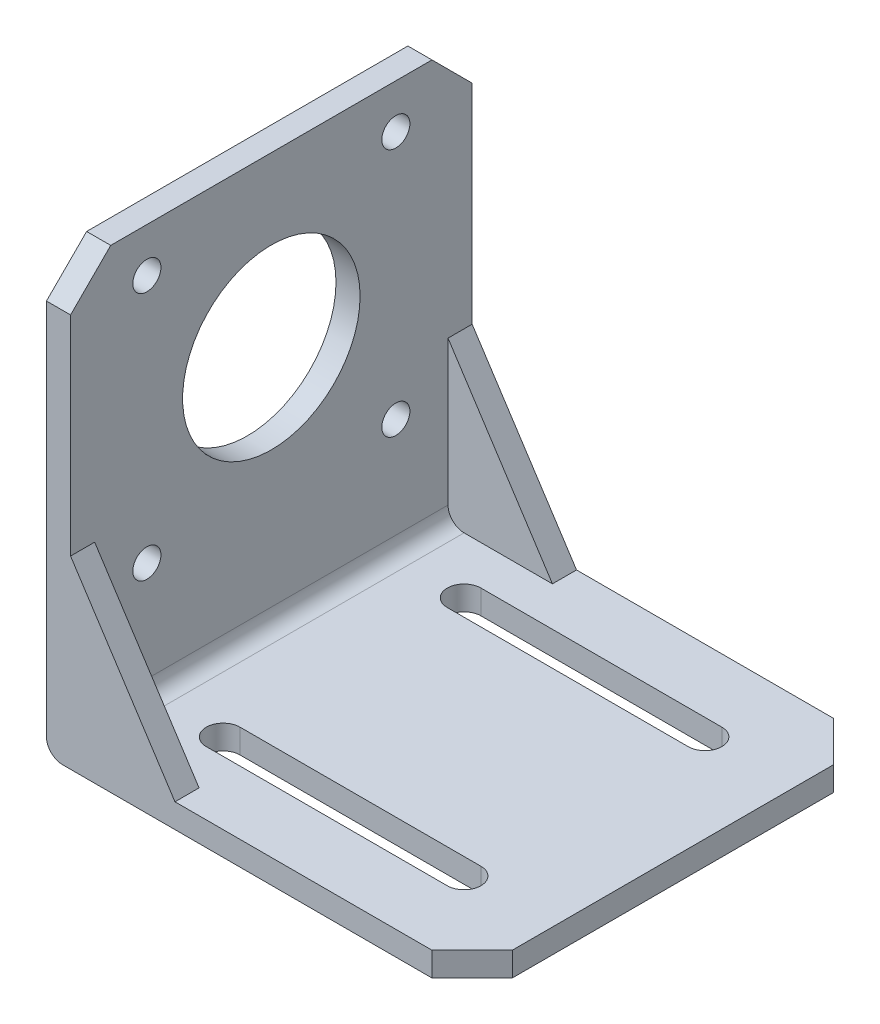
ISO-10303-21;
HEADER;
FILE_DESCRIPTION(('STEP AP214'),'2;1');
FILE_NAME('part.step','',(''),(''),'','','');
FILE_SCHEMA(('AUTOMOTIVE_DESIGN { 1 0 10303 214 1 1 1 1 }'));
ENDSEC;
DATA;
#1=APPLICATION_CONTEXT('core data for automotive mechanical design processes');
#2=APPLICATION_PROTOCOL_DEFINITION('international standard','automotive_design',2000,#1);
#3=PRODUCT_CONTEXT('',#1,'mechanical');
#4=PRODUCT('Part','Part','',(#3));
#5=PRODUCT_RELATED_PRODUCT_CATEGORY('part','',(#4));
#6=PRODUCT_DEFINITION_FORMATION('','',#4);
#7=PRODUCT_DEFINITION_CONTEXT('part definition',#1,'design');
#8=PRODUCT_DEFINITION('design','',#6,#7);
#9=PRODUCT_DEFINITION_SHAPE('','',#8);
#10=(LENGTH_UNIT() NAMED_UNIT(*) SI_UNIT(.MILLI.,.METRE.));
#11=(NAMED_UNIT(*) PLANE_ANGLE_UNIT() SI_UNIT($,.RADIAN.));
#12=(NAMED_UNIT(*) SI_UNIT($,.STERADIAN.) SOLID_ANGLE_UNIT());
#13=UNCERTAINTY_MEASURE_WITH_UNIT(LENGTH_MEASURE(1.E-05),#10,'distance_accuracy_value','');
#14=(GEOMETRIC_REPRESENTATION_CONTEXT(3) GLOBAL_UNCERTAINTY_ASSIGNED_CONTEXT((#13)) GLOBAL_UNIT_ASSIGNED_CONTEXT((#10,
#11,#12)) REPRESENTATION_CONTEXT('',''));
#15=CARTESIAN_POINT('',(0.,0.,0.));
#16=DIRECTION('',(0.,0.,1.));
#17=DIRECTION('',(1.,0.,0.));
#18=AXIS2_PLACEMENT_3D('',#15,#16,#17);
#19=CARTESIAN_POINT('',(-21.5,5.,-25.));
#20=DIRECTION('',(0.,0.,1.));
#21=DIRECTION('',(1.,0.,0.));
#22=AXIS2_PLACEMENT_3D('',#19,#20,#21);
#23=CYLINDRICAL_SURFACE('',#22,2.);
#24=CARTESIAN_POINT('',(-21.5,5.,-22.));
#25=DIRECTION('',(0.,0.,-1.));
#26=DIRECTION('',(-1.,0.,0.));
#27=AXIS2_PLACEMENT_3D('',#24,#25,#26);
#28=CIRCLE('',#27,2.);
#29=CARTESIAN_POINT('',(-23.5,5.,-22.));
#30=VERTEX_POINT('',#29);
#31=CARTESIAN_POINT('',(-21.5,3.,-22.));
#32=VERTEX_POINT('',#31);
#33=EDGE_CURVE('E210',#30,#32,#28,.F.);
#34=ORIENTED_EDGE('',*,*,#33,.F.);
#35=DIRECTION('',(0.,0.,-1.));
#36=VECTOR('',#35,1.);
#37=CARTESIAN_POINT('',(-23.5,5.,-25.));
#38=LINE('',#37,#36);
#39=CARTESIAN_POINT('',(-23.5,5.,22.));
#40=VERTEX_POINT('',#39);
#41=EDGE_CURVE('E193',#40,#30,#38,.T.);
#42=ORIENTED_EDGE('',*,*,#41,.F.);
#43=CARTESIAN_POINT('',(-21.5,5.,22.));
#44=DIRECTION('',(0.,0.,1.));
#45=DIRECTION('',(1.,0.,0.));
#46=AXIS2_PLACEMENT_3D('',#43,#44,#45);
#47=CIRCLE('',#46,2.);
#48=CARTESIAN_POINT('',(-21.5,3.,22.));
#49=VERTEX_POINT('',#48);
#50=EDGE_CURVE('E363',#49,#40,#47,.F.);
#51=ORIENTED_EDGE('',*,*,#50,.F.);
#52=DIRECTION('',(0.,0.,-1.));
#53=VECTOR('',#52,1.);
#54=CARTESIAN_POINT('',(-21.5,3.,25.));
#55=LINE('',#54,#53);
#56=EDGE_CURVE('E205',#32,#49,#55,.F.);
#57=ORIENTED_EDGE('',*,*,#56,.F.);
#58=EDGE_LOOP('',(#34,#42,#51,#57));
#59=FACE_BOUND('',#58,.T.);
#60=ADVANCED_FACE('F34',(#59),#23,.F.);
#61=CARTESIAN_POINT('',(0.,3.,0.));
#62=DIRECTION('',(0.,-1.,0.));
#63=DIRECTION('',(0.,0.,-1.));
#64=AXIS2_PLACEMENT_3D('',#61,#62,#63);
#65=PLANE('',#64);
#66=DIRECTION('',(1.,0.,0.));
#67=VECTOR('',#66,1.);
#68=CARTESIAN_POINT('',(-14.5,3.,17.1));
#69=LINE('',#68,#67);
#70=CARTESIAN_POINT('',(-14.5,3.,17.1));
#71=VERTEX_POINT('',#70);
#72=CARTESIAN_POINT('',(15.5,3.,17.1));
#73=VERTEX_POINT('',#72);
#74=EDGE_CURVE('E295',#71,#73,#69,.T.);
#75=ORIENTED_EDGE('',*,*,#74,.F.);
#76=CARTESIAN_POINT('',(-14.5,3.,15.));
#77=DIRECTION('',(0.,1.,0.));
#78=DIRECTION('',(0.,0.,1.));
#79=AXIS2_PLACEMENT_3D('',#76,#77,#78);
#80=CIRCLE('',#79,2.1);
#81=CARTESIAN_POINT('',(-14.5,3.,12.9));
#82=VERTEX_POINT('',#81);
#83=EDGE_CURVE('E293',#82,#71,#80,.T.);
#84=ORIENTED_EDGE('',*,*,#83,.F.);
#85=DIRECTION('',(-1.,0.,0.));
#86=VECTOR('',#85,1.);
#87=CARTESIAN_POINT('',(-14.5,3.,12.9));
#88=LINE('',#87,#86);
#89=CARTESIAN_POINT('',(15.5,3.,12.9));
#90=VERTEX_POINT('',#89);
#91=EDGE_CURVE('E301',#90,#82,#88,.T.);
#92=ORIENTED_EDGE('',*,*,#91,.F.);
#93=CARTESIAN_POINT('',(15.5,3.,15.));
#94=DIRECTION('',(0.,1.,0.));
#95=DIRECTION('',(0.,0.,1.));
#96=AXIS2_PLACEMENT_3D('',#93,#94,#95);
#97=CIRCLE('',#96,2.1);
#98=EDGE_CURVE('E298',#73,#90,#97,.T.);
#99=ORIENTED_EDGE('',*,*,#98,.F.);
#100=EDGE_LOOP('',(#75,#84,#92,#99));
#101=FACE_BOUND('',#100,.T.);
#102=DIRECTION('',(1.,0.,0.));
#103=VECTOR('',#102,1.);
#104=CARTESIAN_POINT('',(-14.5,3.,-12.9));
#105=LINE('',#104,#103);
#106=CARTESIAN_POINT('',(-14.5,3.,-12.9));
#107=VERTEX_POINT('',#106);
#108=CARTESIAN_POINT('',(15.5,3.,-12.9));
#109=VERTEX_POINT('',#108);
#110=EDGE_CURVE('E263',#107,#109,#105,.T.);
#111=ORIENTED_EDGE('',*,*,#110,.F.);
#112=CARTESIAN_POINT('',(-14.5,3.,-15.));
#113=DIRECTION('',(0.,1.,0.));
#114=DIRECTION('',(0.,0.,1.));
#115=AXIS2_PLACEMENT_3D('',#112,#113,#114);
#116=CIRCLE('',#115,2.1);
#117=CARTESIAN_POINT('',(-14.5,3.,-17.1));
#118=VERTEX_POINT('',#117);
#119=EDGE_CURVE('E261',#118,#107,#116,.T.);
#120=ORIENTED_EDGE('',*,*,#119,.F.);
#121=DIRECTION('',(-1.,0.,0.));
#122=VECTOR('',#121,1.);
#123=CARTESIAN_POINT('',(-14.5,3.,-17.1));
#124=LINE('',#123,#122);
#125=CARTESIAN_POINT('',(15.5,3.,-17.1));
#126=VERTEX_POINT('',#125);
#127=EDGE_CURVE('E269',#126,#118,#124,.T.);
#128=ORIENTED_EDGE('',*,*,#127,.F.);
#129=CARTESIAN_POINT('',(15.5,3.,-15.));
#130=DIRECTION('',(0.,1.,0.));
#131=DIRECTION('',(0.,0.,1.));
#132=AXIS2_PLACEMENT_3D('',#129,#130,#131);
#133=CIRCLE('',#132,2.1);
#134=EDGE_CURVE('E266',#109,#126,#133,.T.);
#135=ORIENTED_EDGE('',*,*,#134,.F.);
#136=EDGE_LOOP('',(#111,#120,#128,#135));
#137=FACE_BOUND('',#136,.T.);
#138=DIRECTION('',(-1.,0.,0.));
#139=VECTOR('',#138,1.);
#140=CARTESIAN_POINT('',(-26.5,3.,-25.));
#141=LINE('',#140,#139);
#142=CARTESIAN_POINT('',(21.5,3.,-25.));
#143=VERTEX_POINT('',#142);
#144=CARTESIAN_POINT('',(-10.5,3.,-25.));
#145=VERTEX_POINT('',#144);
#146=EDGE_CURVE('E318',#143,#145,#141,.T.);
#147=ORIENTED_EDGE('',*,*,#146,.T.);
#148=DIRECTION('',(0.,0.,-1.));
#149=VECTOR('',#148,1.);
#150=CARTESIAN_POINT('',(-10.5,3.,0.));
#151=LINE('',#150,#149);
#152=CARTESIAN_POINT('',(-10.5,3.,-22.));
#153=VERTEX_POINT('',#152);
#154=EDGE_CURVE('E226',#145,#153,#151,.F.);
#155=ORIENTED_EDGE('',*,*,#154,.T.);
#156=DIRECTION('',(1.,0.,0.));
#157=VECTOR('',#156,1.);
#158=CARTESIAN_POINT('',(0.,3.,-22.));
#159=LINE('',#158,#157);
#160=EDGE_CURVE('E213',#32,#153,#159,.T.);
#161=ORIENTED_EDGE('',*,*,#160,.F.);
#162=ORIENTED_EDGE('',*,*,#56,.T.);
#163=DIRECTION('',(-1.,0.,0.));
#164=VECTOR('',#163,1.);
#165=CARTESIAN_POINT('',(0.,3.,22.));
#166=LINE('',#165,#164);
#167=CARTESIAN_POINT('',(-10.5,3.,22.));
#168=VERTEX_POINT('',#167);
#169=EDGE_CURVE('E235',#168,#49,#166,.T.);
#170=ORIENTED_EDGE('',*,*,#169,.F.);
#171=DIRECTION('',(0.,0.,-1.));
#172=VECTOR('',#171,1.);
#173=CARTESIAN_POINT('',(-10.5,3.,0.));
#174=LINE('',#173,#172);
#175=CARTESIAN_POINT('',(-10.5,3.,25.));
#176=VERTEX_POINT('',#175);
#177=EDGE_CURVE('E238',#168,#176,#174,.F.);
#178=ORIENTED_EDGE('',*,*,#177,.T.);
#179=DIRECTION('',(1.,0.,0.));
#180=VECTOR('',#179,1.);
#181=CARTESIAN_POINT('',(-26.5,3.,25.));
#182=LINE('',#181,#180);
#183=CARTESIAN_POINT('',(21.5,3.,25.));
#184=VERTEX_POINT('',#183);
#185=EDGE_CURVE('E321',#176,#184,#182,.T.);
#186=ORIENTED_EDGE('',*,*,#185,.T.);
#187=DIRECTION('',(-0.707106781186549,0.,0.707106781186546));
#188=VECTOR('',#187,1.);
#189=CARTESIAN_POINT('',(26.5,3.,20.));
#190=LINE('',#189,#188);
#191=CARTESIAN_POINT('',(26.5,3.,20.));
#192=VERTEX_POINT('',#191);
#193=EDGE_CURVE('E345',#184,#192,#190,.F.);
#194=ORIENTED_EDGE('',*,*,#193,.T.);
#195=DIRECTION('',(0.,0.,-1.));
#196=VECTOR('',#195,1.);
#197=CARTESIAN_POINT('',(26.5,3.,25.));
#198=LINE('',#197,#196);
#199=CARTESIAN_POINT('',(26.5,3.,-20.));
#200=VERTEX_POINT('',#199);
#201=EDGE_CURVE('E315',#192,#200,#198,.T.);
#202=ORIENTED_EDGE('',*,*,#201,.T.);
#203=DIRECTION('',(0.707106781186546,0.,0.707106781186549));
#204=VECTOR('',#203,1.);
#205=CARTESIAN_POINT('',(21.5,3.,-25.));
#206=LINE('',#205,#204);
#207=EDGE_CURVE('E347',#200,#143,#206,.F.);
#208=ORIENTED_EDGE('',*,*,#207,.T.);
#209=EDGE_LOOP('',(#147,#155,#161,#162,#170,#178,#186,#194,#202,#208));
#210=FACE_BOUND('',#209,.T.);
#211=ADVANCED_FACE('F414',(#101,#137,#210),#65,.F.);
#212=CARTESIAN_POINT('',(26.5,3.,25.));
#213=DIRECTION('',(-1.,0.,0.));
#214=DIRECTION('',(0.,0.,1.));
#215=AXIS2_PLACEMENT_3D('',#212,#213,#214);
#216=PLANE('',#215);
#217=DIRECTION('',(0.,0.,-1.));
#218=VECTOR('',#217,1.);
#219=CARTESIAN_POINT('',(26.5,0.,25.));
#220=LINE('',#219,#218);
#221=CARTESIAN_POINT('',(26.5,0.,20.));
#222=VERTEX_POINT('',#221);
#223=CARTESIAN_POINT('',(26.5,0.,-20.));
#224=VERTEX_POINT('',#223);
#225=EDGE_CURVE('E284',#222,#224,#220,.T.);
#226=ORIENTED_EDGE('',*,*,#225,.T.);
#227=DIRECTION('',(0.,1.,0.));
#228=VECTOR('',#227,1.);
#229=CARTESIAN_POINT('',(26.5,3.,-20.));
#230=LINE('',#229,#228);
#231=EDGE_CURVE('E343',#224,#200,#230,.T.);
#232=ORIENTED_EDGE('',*,*,#231,.T.);
#233=ORIENTED_EDGE('',*,*,#201,.F.);
#234=DIRECTION('',(0.,-1.,0.));
#235=VECTOR('',#234,1.);
#236=CARTESIAN_POINT('',(26.5,3.,20.));
#237=LINE('',#236,#235);
#238=EDGE_CURVE('E340',#192,#222,#237,.T.);
#239=ORIENTED_EDGE('',*,*,#238,.T.);
#240=EDGE_LOOP('',(#226,#232,#233,#239));
#241=FACE_BOUND('',#240,.T.);
#242=ADVANCED_FACE('F484',(#241),#216,.F.);
#243=CARTESIAN_POINT('',(-26.5,3.,-25.));
#244=DIRECTION('',(0.,0.,1.));
#245=DIRECTION('',(1.,0.,0.));
#246=AXIS2_PLACEMENT_3D('',#243,#244,#245);
#247=PLANE('',#246);
#248=DIRECTION('',(0.,-1.,0.));
#249=VECTOR('',#248,1.);
#250=CARTESIAN_POINT('',(-26.5,3.,-25.));
#251=LINE('',#250,#249);
#252=CARTESIAN_POINT('',(-26.5,49.,-25.));
#253=VERTEX_POINT('',#252);
#254=CARTESIAN_POINT('',(-26.5,2.,-25.));
#255=VERTEX_POINT('',#254);
#256=EDGE_CURVE('E330',#253,#255,#251,.T.);
#257=ORIENTED_EDGE('',*,*,#256,.F.);
#258=DIRECTION('',(1.,0.,0.));
#259=VECTOR('',#258,1.);
#260=CARTESIAN_POINT('',(-23.5,49.,-25.));
#261=LINE('',#260,#259);
#262=CARTESIAN_POINT('',(-23.5,49.,-25.));
#263=VERTEX_POINT('',#262);
#264=EDGE_CURVE('E57',#253,#263,#261,.T.);
#265=ORIENTED_EDGE('',*,*,#264,.T.);
#266=DIRECTION('',(0.,-1.,0.));
#267=VECTOR('',#266,1.);
#268=CARTESIAN_POINT('',(-23.5,54.,-25.));
#269=LINE('',#268,#267);
#270=CARTESIAN_POINT('',(-23.5,23.,-25.));
#271=VERTEX_POINT('',#270);
#272=EDGE_CURVE('E246',#263,#271,#269,.T.);
#273=ORIENTED_EDGE('',*,*,#272,.T.);
#274=DIRECTION('',(-0.544988350595414,0.838443616300637,0.));
#275=VECTOR('',#274,1.);
#276=CARTESIAN_POINT('',(-10.5,3.,-25.));
#277=LINE('',#276,#275);
#278=EDGE_CURVE('E219',#145,#271,#277,.T.);
#279=ORIENTED_EDGE('',*,*,#278,.F.);
#280=ORIENTED_EDGE('',*,*,#146,.F.);
#281=DIRECTION('',(0.,-1.,0.));
#282=VECTOR('',#281,1.);
#283=CARTESIAN_POINT('',(21.5,3.,-25.));
#284=LINE('',#283,#282);
#285=CARTESIAN_POINT('',(21.5,0.,-25.));
#286=VERTEX_POINT('',#285);
#287=EDGE_CURVE('E332',#143,#286,#284,.T.);
#288=ORIENTED_EDGE('',*,*,#287,.T.);
#289=DIRECTION('',(-1.,0.,0.));
#290=VECTOR('',#289,1.);
#291=CARTESIAN_POINT('',(-26.5,0.,-25.));
#292=LINE('',#291,#290);
#293=CARTESIAN_POINT('',(-24.5,0.,-25.));
#294=VERTEX_POINT('',#293);
#295=EDGE_CURVE('E326',#286,#294,#292,.T.);
#296=ORIENTED_EDGE('',*,*,#295,.T.);
#297=CARTESIAN_POINT('',(-24.5,2.,-25.));
#298=DIRECTION('',(0.,0.,1.));
#299=DIRECTION('',(1.,0.,0.));
#300=AXIS2_PLACEMENT_3D('',#297,#298,#299);
#301=CIRCLE('',#300,2.);
#302=EDGE_CURVE('E206',#294,#255,#301,.F.);
#303=ORIENTED_EDGE('',*,*,#302,.T.);
#304=EDGE_LOOP('',(#257,#265,#273,#279,#280,#288,#296,#303));
#305=FACE_BOUND('',#304,.T.);
#306=ADVANCED_FACE('F390',(#305),#247,.F.);
#307=CARTESIAN_POINT('',(-26.5,3.,25.));
#308=DIRECTION('',(1.,0.,0.));
#309=DIRECTION('',(0.,0.,-1.));
#310=AXIS2_PLACEMENT_3D('',#307,#308,#309);
#311=PLANE('',#310);
#312=CARTESIAN_POINT('',(-26.5,48.5,15.5));
#313=DIRECTION('',(1.,0.,0.));
#314=DIRECTION('',(0.,0.,-1.));
#315=AXIS2_PLACEMENT_3D('',#312,#313,#314);
#316=CIRCLE('',#315,1.75);
#317=CARTESIAN_POINT('',(-26.5,48.5,13.75));
#318=VERTEX_POINT('',#317);
#319=EDGE_CURVE('E446',#318,#318,#316,.T.);
#320=ORIENTED_EDGE('',*,*,#319,.T.);
#321=EDGE_LOOP('',(#320));
#322=FACE_BOUND('',#321,.T.);
#323=CARTESIAN_POINT('',(-26.5,17.5,15.5));
#324=DIRECTION('',(1.,0.,0.));
#325=DIRECTION('',(0.,0.,-1.));
#326=AXIS2_PLACEMENT_3D('',#323,#324,#325);
#327=CIRCLE('',#326,1.75);
#328=CARTESIAN_POINT('',(-26.5,17.5,13.75));
#329=VERTEX_POINT('',#328);
#330=EDGE_CURVE('E440',#329,#329,#327,.T.);
#331=ORIENTED_EDGE('',*,*,#330,.T.);
#332=EDGE_LOOP('',(#331));
#333=FACE_BOUND('',#332,.T.);
#334=CARTESIAN_POINT('',(-26.5,17.5,-15.5));
#335=DIRECTION('',(1.,0.,0.));
#336=DIRECTION('',(0.,0.,-1.));
#337=AXIS2_PLACEMENT_3D('',#334,#335,#336);
#338=CIRCLE('',#337,1.75);
#339=CARTESIAN_POINT('',(-26.5,17.5,-17.25));
#340=VERTEX_POINT('',#339);
#341=EDGE_CURVE('E434',#340,#340,#338,.T.);
#342=ORIENTED_EDGE('',*,*,#341,.T.);
#343=EDGE_LOOP('',(#342));
#344=FACE_BOUND('',#343,.T.);
#345=CARTESIAN_POINT('',(-26.5,48.5,-15.5));
#346=DIRECTION('',(1.,0.,0.));
#347=DIRECTION('',(0.,0.,-1.));
#348=AXIS2_PLACEMENT_3D('',#345,#346,#347);
#349=CIRCLE('',#348,1.75);
#350=CARTESIAN_POINT('',(-26.5,48.5,-17.25));
#351=VERTEX_POINT('',#350);
#352=EDGE_CURVE('E426',#351,#351,#349,.T.);
#353=ORIENTED_EDGE('',*,*,#352,.T.);
#354=EDGE_LOOP('',(#353));
#355=FACE_BOUND('',#354,.T.);
#356=CARTESIAN_POINT('',(-26.5,33.,0.));
#357=DIRECTION('',(1.,0.,0.));
#358=DIRECTION('',(0.,0.,-1.));
#359=AXIS2_PLACEMENT_3D('',#356,#357,#358);
#360=CIRCLE('',#359,11.05);
#361=CARTESIAN_POINT('',(-26.5,33.,-11.05));
#362=VERTEX_POINT('',#361);
#363=EDGE_CURVE('E419',#362,#362,#360,.F.);
#364=ORIENTED_EDGE('',*,*,#363,.F.);
#365=EDGE_LOOP('',(#364));
#366=FACE_BOUND('',#365,.T.);
#367=DIRECTION('',(0.,0.,1.));
#368=VECTOR('',#367,1.);
#369=CARTESIAN_POINT('',(-26.5,54.,-25.));
#370=LINE('',#369,#368);
#371=CARTESIAN_POINT('',(-26.5,54.,-20.));
#372=VERTEX_POINT('',#371);
#373=CARTESIAN_POINT('',(-26.5,54.,20.));
#374=VERTEX_POINT('',#373);
#375=EDGE_CURVE('E240',#372,#374,#370,.T.);
#376=ORIENTED_EDGE('',*,*,#375,.F.);
#377=DIRECTION('',(0.,-0.707106781186549,-0.707106781186547));
#378=VECTOR('',#377,1.);
#379=CARTESIAN_POINT('',(-26.5,54.,-20.));
#380=LINE('',#379,#378);
#381=EDGE_CURVE('E377',#372,#253,#380,.T.);
#382=ORIENTED_EDGE('',*,*,#381,.T.);
#383=ORIENTED_EDGE('',*,*,#256,.T.);
#384=DIRECTION('',(0.,0.,1.));
#385=VECTOR('',#384,1.);
#386=CARTESIAN_POINT('',(-26.5,2.,25.));
#387=LINE('',#386,#385);
#388=CARTESIAN_POINT('',(-26.5,2.,25.));
#389=VERTEX_POINT('',#388);
#390=EDGE_CURVE('E352',#255,#389,#387,.T.);
#391=ORIENTED_EDGE('',*,*,#390,.T.);
#392=DIRECTION('',(0.,-1.,0.));
#393=VECTOR('',#392,1.);
#394=CARTESIAN_POINT('',(-26.5,3.,25.));
#395=LINE('',#394,#393);
#396=CARTESIAN_POINT('',(-26.5,49.,25.));
#397=VERTEX_POINT('',#396);
#398=EDGE_CURVE('E323',#397,#389,#395,.T.);
#399=ORIENTED_EDGE('',*,*,#398,.F.);
#400=DIRECTION('',(0.,0.707106781186549,-0.707106781186547));
#401=VECTOR('',#400,1.);
#402=CARTESIAN_POINT('',(-26.5,54.,20.));
#403=LINE('',#402,#401);
#404=EDGE_CURVE('E375',#397,#374,#403,.T.);
#405=ORIENTED_EDGE('',*,*,#404,.T.);
#406=EDGE_LOOP('',(#376,#382,#383,#391,#399,#405));
#407=FACE_BOUND('',#406,.T.);
#408=ADVANCED_FACE('F389',(#322,#333,#344,#355,#366,#407),#311,.F.);
#409=CARTESIAN_POINT('',(-26.5,3.,25.));
#410=DIRECTION('',(0.,0.,-1.));
#411=DIRECTION('',(-1.,0.,0.));
#412=AXIS2_PLACEMENT_3D('',#409,#410,#411);
#413=PLANE('',#412);
#414=DIRECTION('',(0.,-1.,0.));
#415=VECTOR('',#414,1.);
#416=CARTESIAN_POINT('',(-23.5,54.,25.));
#417=LINE('',#416,#415);
#418=CARTESIAN_POINT('',(-23.5,49.,25.));
#419=VERTEX_POINT('',#418);
#420=CARTESIAN_POINT('',(-23.5,23.,25.));
#421=VERTEX_POINT('',#420);
#422=EDGE_CURVE('E248',#419,#421,#417,.T.);
#423=ORIENTED_EDGE('',*,*,#422,.F.);
#424=DIRECTION('',(-1.,0.,0.));
#425=VECTOR('',#424,1.);
#426=CARTESIAN_POINT('',(-26.5,49.,25.));
#427=LINE('',#426,#425);
#428=EDGE_CURVE('E11',#419,#397,#427,.T.);
#429=ORIENTED_EDGE('',*,*,#428,.T.);
#430=ORIENTED_EDGE('',*,*,#398,.T.);
#431=CARTESIAN_POINT('',(-24.5,2.,25.));
#432=DIRECTION('',(0.,0.,-1.));
#433=DIRECTION('',(-1.,0.,0.));
#434=AXIS2_PLACEMENT_3D('',#431,#432,#433);
#435=CIRCLE('',#434,2.);
#436=CARTESIAN_POINT('',(-24.5,0.,25.));
#437=VERTEX_POINT('',#436);
#438=EDGE_CURVE('E355',#389,#437,#435,.F.);
#439=ORIENTED_EDGE('',*,*,#438,.T.);
#440=DIRECTION('',(1.,0.,0.));
#441=VECTOR('',#440,1.);
#442=CARTESIAN_POINT('',(-26.5,0.,25.));
#443=LINE('',#442,#441);
#444=CARTESIAN_POINT('',(21.5,0.,25.));
#445=VERTEX_POINT('',#444);
#446=EDGE_CURVE('E319',#437,#445,#443,.T.);
#447=ORIENTED_EDGE('',*,*,#446,.T.);
#448=DIRECTION('',(0.,1.,0.));
#449=VECTOR('',#448,1.);
#450=CARTESIAN_POINT('',(21.5,3.,25.));
#451=LINE('',#450,#449);
#452=EDGE_CURVE('E349',#445,#184,#451,.T.);
#453=ORIENTED_EDGE('',*,*,#452,.T.);
#454=ORIENTED_EDGE('',*,*,#185,.F.);
#455=DIRECTION('',(0.544988350595414,-0.838443616300637,0.));
#456=VECTOR('',#455,1.);
#457=CARTESIAN_POINT('',(-23.5,23.,25.));
#458=LINE('',#457,#456);
#459=EDGE_CURVE('E229',#421,#176,#458,.T.);
#460=ORIENTED_EDGE('',*,*,#459,.F.);
#461=EDGE_LOOP('',(#423,#429,#430,#439,#447,#453,#454,#460));
#462=FACE_BOUND('',#461,.T.);
#463=ADVANCED_FACE('F403',(#462),#413,.F.);
#464=CARTESIAN_POINT('',(0.,0.,0.));
#465=DIRECTION('',(0.,-1.,0.));
#466=DIRECTION('',(0.,0.,-1.));
#467=AXIS2_PLACEMENT_3D('',#464,#465,#466);
#468=PLANE('',#467);
#469=DIRECTION('',(0.,0.,1.));
#470=VECTOR('',#469,1.);
#471=CARTESIAN_POINT('',(-24.5,0.,-25.));
#472=LINE('',#471,#470);
#473=EDGE_CURVE('E357',#437,#294,#472,.F.);
#474=ORIENTED_EDGE('',*,*,#473,.T.);
#475=ORIENTED_EDGE('',*,*,#295,.F.);
#476=DIRECTION('',(-0.707106781186546,0.,-0.707106781186549));
#477=VECTOR('',#476,1.);
#478=CARTESIAN_POINT('',(23.2500000000001,0.,-23.25));
#479=LINE('',#478,#477);
#480=EDGE_CURVE('E338',#286,#224,#479,.F.);
#481=ORIENTED_EDGE('',*,*,#480,.T.);
#482=ORIENTED_EDGE('',*,*,#225,.F.);
#483=DIRECTION('',(0.707106781186549,0.,-0.707106781186546));
#484=VECTOR('',#483,1.);
#485=CARTESIAN_POINT('',(23.2499999999999,0.,23.25));
#486=LINE('',#485,#484);
#487=EDGE_CURVE('E335',#222,#445,#486,.F.);
#488=ORIENTED_EDGE('',*,*,#487,.T.);
#489=ORIENTED_EDGE('',*,*,#446,.F.);
#490=EDGE_LOOP('',(#474,#475,#481,#482,#488,#489));
#491=FACE_BOUND('',#490,.T.);
#492=CARTESIAN_POINT('',(-14.5,0.,-15.));
#493=DIRECTION('',(0.,-1.,0.));
#494=DIRECTION('',(0.,0.,-1.));
#495=AXIS2_PLACEMENT_3D('',#492,#493,#494);
#496=CIRCLE('',#495,2.1);
#497=CARTESIAN_POINT('',(-14.5,0.,-17.1));
#498=VERTEX_POINT('',#497);
#499=CARTESIAN_POINT('',(-14.5,0.,-12.9));
#500=VERTEX_POINT('',#499);
#501=EDGE_CURVE('E258',#498,#500,#496,.F.);
#502=ORIENTED_EDGE('',*,*,#501,.T.);
#503=DIRECTION('',(1.,0.,0.));
#504=VECTOR('',#503,1.);
#505=CARTESIAN_POINT('',(-14.5,0.,-12.9));
#506=LINE('',#505,#504);
#507=CARTESIAN_POINT('',(15.5,0.,-12.9));
#508=VERTEX_POINT('',#507);
#509=EDGE_CURVE('E275',#500,#508,#506,.T.);
#510=ORIENTED_EDGE('',*,*,#509,.T.);
#511=CARTESIAN_POINT('',(15.5,0.,-15.));
#512=DIRECTION('',(0.,-1.,0.));
#513=DIRECTION('',(0.,0.,-1.));
#514=AXIS2_PLACEMENT_3D('',#511,#512,#513);
#515=CIRCLE('',#514,2.1);
#516=CARTESIAN_POINT('',(15.5,0.,-17.1));
#517=VERTEX_POINT('',#516);
#518=EDGE_CURVE('E251',#508,#517,#515,.F.);
#519=ORIENTED_EDGE('',*,*,#518,.T.);
#520=DIRECTION('',(-1.,0.,0.));
#521=VECTOR('',#520,1.);
#522=CARTESIAN_POINT('',(-14.5,0.,-17.1));
#523=LINE('',#522,#521);
#524=EDGE_CURVE('E254',#517,#498,#523,.T.);
#525=ORIENTED_EDGE('',*,*,#524,.T.);
#526=EDGE_LOOP('',(#502,#510,#519,#525));
#527=FACE_BOUND('',#526,.T.);
#528=CARTESIAN_POINT('',(-14.5,0.,15.));
#529=DIRECTION('',(0.,-1.,0.));
#530=DIRECTION('',(0.,0.,-1.));
#531=AXIS2_PLACEMENT_3D('',#528,#529,#530);
#532=CIRCLE('',#531,2.1);
#533=CARTESIAN_POINT('',(-14.5,0.,12.9));
#534=VERTEX_POINT('',#533);
#535=CARTESIAN_POINT('',(-14.5,0.,17.1));
#536=VERTEX_POINT('',#535);
#537=EDGE_CURVE('E290',#534,#536,#532,.F.);
#538=ORIENTED_EDGE('',*,*,#537,.T.);
#539=DIRECTION('',(1.,0.,0.));
#540=VECTOR('',#539,1.);
#541=CARTESIAN_POINT('',(-14.5,0.,17.1));
#542=LINE('',#541,#540);
#543=CARTESIAN_POINT('',(15.5,0.,17.1));
#544=VERTEX_POINT('',#543);
#545=EDGE_CURVE('E255',#536,#544,#542,.T.);
#546=ORIENTED_EDGE('',*,*,#545,.T.);
#547=CARTESIAN_POINT('',(15.5,0.,15.));
#548=DIRECTION('',(0.,-1.,0.));
#549=DIRECTION('',(0.,0.,-1.));
#550=AXIS2_PLACEMENT_3D('',#547,#548,#549);
#551=CIRCLE('',#550,2.1);
#552=CARTESIAN_POINT('',(15.5,0.,12.9));
#553=VERTEX_POINT('',#552);
#554=EDGE_CURVE('E250',#544,#553,#551,.F.);
#555=ORIENTED_EDGE('',*,*,#554,.T.);
#556=DIRECTION('',(-1.,0.,0.));
#557=VECTOR('',#556,1.);
#558=CARTESIAN_POINT('',(-14.5,0.,12.9));
#559=LINE('',#558,#557);
#560=EDGE_CURVE('E287',#553,#534,#559,.T.);
#561=ORIENTED_EDGE('',*,*,#560,.T.);
#562=EDGE_LOOP('',(#538,#546,#555,#561));
#563=FACE_BOUND('',#562,.T.);
#564=ADVANCED_FACE('F536',(#491,#527,#563),#468,.T.);
#565=CARTESIAN_POINT('',(21.5,3.,-25.));
#566=DIRECTION('',(-0.707106781186549,0.,0.707106781186546));
#567=DIRECTION('',(0.,-1.,0.));
#568=AXIS2_PLACEMENT_3D('',#565,#566,#567);
#569=PLANE('',#568);
#570=ORIENTED_EDGE('',*,*,#207,.F.);
#571=ORIENTED_EDGE('',*,*,#231,.F.);
#572=ORIENTED_EDGE('',*,*,#480,.F.);
#573=ORIENTED_EDGE('',*,*,#287,.F.);
#574=EDGE_LOOP('',(#570,#571,#572,#573));
#575=FACE_BOUND('',#574,.T.);
#576=ADVANCED_FACE('F539',(#575),#569,.F.);
#577=CARTESIAN_POINT('',(26.5,3.,20.));
#578=DIRECTION('',(-0.707106781186546,0.,-0.707106781186549));
#579=DIRECTION('',(0.,-1.,0.));
#580=AXIS2_PLACEMENT_3D('',#577,#578,#579);
#581=PLANE('',#580);
#582=ORIENTED_EDGE('',*,*,#193,.F.);
#583=ORIENTED_EDGE('',*,*,#452,.F.);
#584=ORIENTED_EDGE('',*,*,#487,.F.);
#585=ORIENTED_EDGE('',*,*,#238,.F.);
#586=EDGE_LOOP('',(#582,#583,#584,#585));
#587=FACE_BOUND('',#586,.T.);
#588=ADVANCED_FACE('F533',(#587),#581,.F.);
#589=CARTESIAN_POINT('',(-14.5,-0.00100000000000013,15.));
#590=DIRECTION('',(0.,1.,0.));
#591=DIRECTION('',(0.,0.,1.));
#592=AXIS2_PLACEMENT_3D('',#589,#590,#591);
#593=CYLINDRICAL_SURFACE('',#592,2.1);
#594=DIRECTION('',(0.,1.,0.));
#595=VECTOR('',#594,1.);
#596=CARTESIAN_POINT('',(-14.5,-0.00100000000000013,12.9));
#597=LINE('',#596,#595);
#598=EDGE_CURVE('E305',#534,#82,#597,.T.);
#599=ORIENTED_EDGE('',*,*,#598,.T.);
#600=ORIENTED_EDGE('',*,*,#83,.T.);
#601=DIRECTION('',(0.,1.,0.));
#602=VECTOR('',#601,1.);
#603=CARTESIAN_POINT('',(-14.5,-0.00100000000000013,17.1));
#604=LINE('',#603,#602);
#605=EDGE_CURVE('E304',#536,#71,#604,.T.);
#606=ORIENTED_EDGE('',*,*,#605,.F.);
#607=ORIENTED_EDGE('',*,*,#537,.F.);
#608=EDGE_LOOP('',(#599,#600,#606,#607));
#609=FACE_BOUND('',#608,.T.);
#610=ADVANCED_FACE('F524',(#609),#593,.F.);
#611=CARTESIAN_POINT('',(-14.5,-0.00100000000000013,12.9));
#612=DIRECTION('',(0.,0.,-1.));
#613=DIRECTION('',(-1.,0.,0.));
#614=AXIS2_PLACEMENT_3D('',#611,#612,#613);
#615=PLANE('',#614);
#616=DIRECTION('',(0.,1.,0.));
#617=VECTOR('',#616,1.);
#618=CARTESIAN_POINT('',(15.5,-0.00100000000000013,12.9));
#619=LINE('',#618,#617);
#620=EDGE_CURVE('E307',#553,#90,#619,.T.);
#621=ORIENTED_EDGE('',*,*,#620,.T.);
#622=ORIENTED_EDGE('',*,*,#91,.T.);
#623=ORIENTED_EDGE('',*,*,#598,.F.);
#624=ORIENTED_EDGE('',*,*,#560,.F.);
#625=EDGE_LOOP('',(#621,#622,#623,#624));
#626=FACE_BOUND('',#625,.T.);
#627=ADVANCED_FACE('F520',(#626),#615,.F.);
#628=CARTESIAN_POINT('',(15.5,-0.00100000000000013,15.));
#629=DIRECTION('',(0.,1.,0.));
#630=DIRECTION('',(0.,0.,1.));
#631=AXIS2_PLACEMENT_3D('',#628,#629,#630);
#632=CYLINDRICAL_SURFACE('',#631,2.1);
#633=DIRECTION('',(0.,1.,0.));
#634=VECTOR('',#633,1.);
#635=CARTESIAN_POINT('',(15.5,-0.00100000000000013,17.1));
#636=LINE('',#635,#634);
#637=EDGE_CURVE('E309',#544,#73,#636,.T.);
#638=ORIENTED_EDGE('',*,*,#637,.T.);
#639=ORIENTED_EDGE('',*,*,#98,.T.);
#640=ORIENTED_EDGE('',*,*,#620,.F.);
#641=ORIENTED_EDGE('',*,*,#554,.F.);
#642=EDGE_LOOP('',(#638,#639,#640,#641));
#643=FACE_BOUND('',#642,.T.);
#644=ADVANCED_FACE('F523',(#643),#632,.F.);
#645=CARTESIAN_POINT('',(-14.5,-0.00100000000000013,17.1));
#646=DIRECTION('',(0.,0.,1.));
#647=DIRECTION('',(1.,0.,0.));
#648=AXIS2_PLACEMENT_3D('',#645,#646,#647);
#649=PLANE('',#648);
#650=ORIENTED_EDGE('',*,*,#605,.T.);
#651=ORIENTED_EDGE('',*,*,#74,.T.);
#652=ORIENTED_EDGE('',*,*,#637,.F.);
#653=ORIENTED_EDGE('',*,*,#545,.F.);
#654=EDGE_LOOP('',(#650,#651,#652,#653));
#655=FACE_BOUND('',#654,.T.);
#656=ADVANCED_FACE('F518',(#655),#649,.F.);
#657=CARTESIAN_POINT('',(-14.5,-0.00100000000000013,-15.));
#658=DIRECTION('',(0.,1.,0.));
#659=DIRECTION('',(0.,0.,1.));
#660=AXIS2_PLACEMENT_3D('',#657,#658,#659);
#661=CYLINDRICAL_SURFACE('',#660,2.1);
#662=DIRECTION('',(0.,1.,0.));
#663=VECTOR('',#662,1.);
#664=CARTESIAN_POINT('',(-14.5,-0.00100000000000013,-17.1));
#665=LINE('',#664,#663);
#666=EDGE_CURVE('E273',#498,#118,#665,.T.);
#667=ORIENTED_EDGE('',*,*,#666,.T.);
#668=ORIENTED_EDGE('',*,*,#119,.T.);
#669=DIRECTION('',(0.,1.,0.));
#670=VECTOR('',#669,1.);
#671=CARTESIAN_POINT('',(-14.5,-0.00100000000000013,-12.9));
#672=LINE('',#671,#670);
#673=EDGE_CURVE('E272',#500,#107,#672,.T.);
#674=ORIENTED_EDGE('',*,*,#673,.F.);
#675=ORIENTED_EDGE('',*,*,#501,.F.);
#676=EDGE_LOOP('',(#667,#668,#674,#675));
#677=FACE_BOUND('',#676,.T.);
#678=ADVANCED_FACE('F508',(#677),#661,.F.);
#679=CARTESIAN_POINT('',(-14.5,-0.00100000000000013,-17.1));
#680=DIRECTION('',(0.,0.,-1.));
#681=DIRECTION('',(-1.,0.,0.));
#682=AXIS2_PLACEMENT_3D('',#679,#680,#681);
#683=PLANE('',#682);
#684=DIRECTION('',(0.,1.,0.));
#685=VECTOR('',#684,1.);
#686=CARTESIAN_POINT('',(15.5,-0.00100000000000013,-17.1));
#687=LINE('',#686,#685);
#688=EDGE_CURVE('E276',#517,#126,#687,.T.);
#689=ORIENTED_EDGE('',*,*,#688,.T.);
#690=ORIENTED_EDGE('',*,*,#127,.T.);
#691=ORIENTED_EDGE('',*,*,#666,.F.);
#692=ORIENTED_EDGE('',*,*,#524,.F.);
#693=EDGE_LOOP('',(#689,#690,#691,#692));
#694=FACE_BOUND('',#693,.T.);
#695=ADVANCED_FACE('F504',(#694),#683,.F.);
#696=CARTESIAN_POINT('',(15.5,-0.00100000000000013,-15.));
#697=DIRECTION('',(0.,1.,0.));
#698=DIRECTION('',(0.,0.,1.));
#699=AXIS2_PLACEMENT_3D('',#696,#697,#698);
#700=CYLINDRICAL_SURFACE('',#699,2.1);
#701=DIRECTION('',(0.,1.,0.));
#702=VECTOR('',#701,1.);
#703=CARTESIAN_POINT('',(15.5,-0.00100000000000013,-12.9));
#704=LINE('',#703,#702);
#705=EDGE_CURVE('E278',#508,#109,#704,.T.);
#706=ORIENTED_EDGE('',*,*,#705,.T.);
#707=ORIENTED_EDGE('',*,*,#134,.T.);
#708=ORIENTED_EDGE('',*,*,#688,.F.);
#709=ORIENTED_EDGE('',*,*,#518,.F.);
#710=EDGE_LOOP('',(#706,#707,#708,#709));
#711=FACE_BOUND('',#710,.T.);
#712=ADVANCED_FACE('F507',(#711),#700,.F.);
#713=CARTESIAN_POINT('',(-14.5,-0.00100000000000013,-12.9));
#714=DIRECTION('',(0.,0.,1.));
#715=DIRECTION('',(1.,0.,0.));
#716=AXIS2_PLACEMENT_3D('',#713,#714,#715);
#717=PLANE('',#716);
#718=ORIENTED_EDGE('',*,*,#673,.T.);
#719=ORIENTED_EDGE('',*,*,#110,.T.);
#720=ORIENTED_EDGE('',*,*,#705,.F.);
#721=ORIENTED_EDGE('',*,*,#509,.F.);
#722=EDGE_LOOP('',(#718,#719,#720,#721));
#723=FACE_BOUND('',#722,.T.);
#724=ADVANCED_FACE('F457',(#723),#717,.F.);
#725=CARTESIAN_POINT('',(-23.5,54.,-25.));
#726=DIRECTION('',(-1.,0.,0.));
#727=DIRECTION('',(0.,0.,1.));
#728=AXIS2_PLACEMENT_3D('',#725,#726,#727);
#729=PLANE('',#728);
#730=CARTESIAN_POINT('',(-23.5,48.5,15.5));
#731=DIRECTION('',(1.,0.,0.));
#732=DIRECTION('',(0.,0.,-1.));
#733=AXIS2_PLACEMENT_3D('',#730,#731,#732);
#734=CIRCLE('',#733,1.75);
#735=CARTESIAN_POINT('',(-23.5,48.5,13.75));
#736=VERTEX_POINT('',#735);
#737=EDGE_CURVE('E449',#736,#736,#734,.T.);
#738=ORIENTED_EDGE('',*,*,#737,.F.);
#739=EDGE_LOOP('',(#738));
#740=FACE_BOUND('',#739,.T.);
#741=CARTESIAN_POINT('',(-23.5,17.5,15.5));
#742=DIRECTION('',(1.,0.,0.));
#743=DIRECTION('',(0.,0.,-1.));
#744=AXIS2_PLACEMENT_3D('',#741,#742,#743);
#745=CIRCLE('',#744,1.75);
#746=CARTESIAN_POINT('',(-23.5,17.5,13.75));
#747=VERTEX_POINT('',#746);
#748=EDGE_CURVE('E443',#747,#747,#745,.T.);
#749=ORIENTED_EDGE('',*,*,#748,.F.);
#750=EDGE_LOOP('',(#749));
#751=FACE_BOUND('',#750,.T.);
#752=CARTESIAN_POINT('',(-23.5,17.5,-15.5));
#753=DIRECTION('',(1.,0.,0.));
#754=DIRECTION('',(0.,0.,-1.));
#755=AXIS2_PLACEMENT_3D('',#752,#753,#754);
#756=CIRCLE('',#755,1.75);
#757=CARTESIAN_POINT('',(-23.5,17.5,-17.25));
#758=VERTEX_POINT('',#757);
#759=EDGE_CURVE('E437',#758,#758,#756,.T.);
#760=ORIENTED_EDGE('',*,*,#759,.F.);
#761=EDGE_LOOP('',(#760));
#762=FACE_BOUND('',#761,.T.);
#763=CARTESIAN_POINT('',(-23.5,48.5,-15.5));
#764=DIRECTION('',(1.,0.,0.));
#765=DIRECTION('',(0.,0.,-1.));
#766=AXIS2_PLACEMENT_3D('',#763,#764,#765);
#767=CIRCLE('',#766,1.75);
#768=CARTESIAN_POINT('',(-23.5,48.5,-17.25));
#769=VERTEX_POINT('',#768);
#770=EDGE_CURVE('E431',#769,#769,#767,.T.);
#771=ORIENTED_EDGE('',*,*,#770,.F.);
#772=EDGE_LOOP('',(#771));
#773=FACE_BOUND('',#772,.T.);
#774=CARTESIAN_POINT('',(-23.5,33.,0.));
#775=DIRECTION('',(1.,0.,0.));
#776=DIRECTION('',(0.,0.,-1.));
#777=AXIS2_PLACEMENT_3D('',#774,#775,#776);
#778=CIRCLE('',#777,11.05);
#779=CARTESIAN_POINT('',(-23.5,33.,-11.05));
#780=VERTEX_POINT('',#779);
#781=EDGE_CURVE('E421',#780,#780,#778,.T.);
#782=ORIENTED_EDGE('',*,*,#781,.F.);
#783=EDGE_LOOP('',(#782));
#784=FACE_BOUND('',#783,.T.);
#785=ORIENTED_EDGE('',*,*,#272,.F.);
#786=DIRECTION('',(0.,0.707106781186549,0.707106781186547));
#787=VECTOR('',#786,1.);
#788=CARTESIAN_POINT('',(-23.5,54.,-20.));
#789=LINE('',#788,#787);
#790=CARTESIAN_POINT('',(-23.5,54.,-20.));
#791=VERTEX_POINT('',#790);
#792=EDGE_CURVE('E42',#263,#791,#789,.T.);
#793=ORIENTED_EDGE('',*,*,#792,.T.);
#794=DIRECTION('',(0.,0.,-1.));
#795=VECTOR('',#794,1.);
#796=CARTESIAN_POINT('',(-23.5,54.,-25.));
#797=LINE('',#796,#795);
#798=CARTESIAN_POINT('',(-23.5,54.,20.));
#799=VERTEX_POINT('',#798);
#800=EDGE_CURVE('E243',#799,#791,#797,.T.);
#801=ORIENTED_EDGE('',*,*,#800,.F.);
#802=DIRECTION('',(0.,-0.707106781186549,0.707106781186547));
#803=VECTOR('',#802,1.);
#804=CARTESIAN_POINT('',(-23.5,54.,20.));
#805=LINE('',#804,#803);
#806=EDGE_CURVE('E49',#799,#419,#805,.T.);
#807=ORIENTED_EDGE('',*,*,#806,.T.);
#808=ORIENTED_EDGE('',*,*,#422,.T.);
#809=DIRECTION('',(0.,0.,1.));
#810=VECTOR('',#809,1.);
#811=CARTESIAN_POINT('',(-23.5,23.,-25.));
#812=LINE('',#811,#810);
#813=CARTESIAN_POINT('',(-23.5,23.,22.));
#814=VERTEX_POINT('',#813);
#815=EDGE_CURVE('E365',#421,#814,#812,.F.);
#816=ORIENTED_EDGE('',*,*,#815,.T.);
#817=DIRECTION('',(0.,1.,0.));
#818=VECTOR('',#817,1.);
#819=CARTESIAN_POINT('',(-23.5,54.,22.));
#820=LINE('',#819,#818);
#821=EDGE_CURVE('E201',#40,#814,#820,.T.);
#822=ORIENTED_EDGE('',*,*,#821,.F.);
#823=ORIENTED_EDGE('',*,*,#41,.T.);
#824=DIRECTION('',(0.,-1.,0.));
#825=VECTOR('',#824,1.);
#826=CARTESIAN_POINT('',(-23.5,54.,-22.));
#827=LINE('',#826,#825);
#828=CARTESIAN_POINT('',(-23.5,23.,-22.));
#829=VERTEX_POINT('',#828);
#830=EDGE_CURVE('E198',#829,#30,#827,.T.);
#831=ORIENTED_EDGE('',*,*,#830,.F.);
#832=DIRECTION('',(0.,0.,1.));
#833=VECTOR('',#832,1.);
#834=CARTESIAN_POINT('',(-23.5,23.,-25.));
#835=LINE('',#834,#833);
#836=EDGE_CURVE('E367',#829,#271,#835,.F.);
#837=ORIENTED_EDGE('',*,*,#836,.T.);
#838=EDGE_LOOP('',(#785,#793,#801,#807,#808,#816,#822,#823,#831,#837));
#839=FACE_BOUND('',#838,.T.);
#840=ADVANCED_FACE('F195',(#740,#751,#762,#773,#784,#839),#729,.F.);
#841=CARTESIAN_POINT('',(0.,54.,0.));
#842=DIRECTION('',(0.,1.,0.));
#843=DIRECTION('',(0.,0.,1.));
#844=AXIS2_PLACEMENT_3D('',#841,#842,#843);
#845=PLANE('',#844);
#846=ORIENTED_EDGE('',*,*,#800,.T.);
#847=DIRECTION('',(-1.,0.,0.));
#848=VECTOR('',#847,1.);
#849=CARTESIAN_POINT('',(-26.5,54.,-20.));
#850=LINE('',#849,#848);
#851=EDGE_CURVE('E372',#791,#372,#850,.T.);
#852=ORIENTED_EDGE('',*,*,#851,.T.);
#853=ORIENTED_EDGE('',*,*,#375,.T.);
#854=DIRECTION('',(1.,0.,0.));
#855=VECTOR('',#854,1.);
#856=CARTESIAN_POINT('',(-23.5,54.,20.));
#857=LINE('',#856,#855);
#858=EDGE_CURVE('E369',#374,#799,#857,.T.);
#859=ORIENTED_EDGE('',*,*,#858,.T.);
#860=EDGE_LOOP('',(#846,#852,#853,#859));
#861=FACE_BOUND('',#860,.T.);
#862=ADVANCED_FACE('F384',(#861),#845,.T.);
#863=CARTESIAN_POINT('',(-24.5,2.,25.));
#864=DIRECTION('',(0.,0.,-1.));
#865=DIRECTION('',(-1.,0.,0.));
#866=AXIS2_PLACEMENT_3D('',#863,#864,#865);
#867=CYLINDRICAL_SURFACE('',#866,2.);
#868=ORIENTED_EDGE('',*,*,#302,.F.);
#869=ORIENTED_EDGE('',*,*,#473,.F.);
#870=ORIENTED_EDGE('',*,*,#438,.F.);
#871=ORIENTED_EDGE('',*,*,#390,.F.);
#872=EDGE_LOOP('',(#868,#869,#870,#871));
#873=FACE_BOUND('',#872,.T.);
#874=ADVANCED_FACE('F397',(#873),#867,.T.);
#875=CARTESIAN_POINT('',(-23.5,23.,25.));
#876=DIRECTION('',(-0.838443616300637,-0.544988350595414,0.));
#877=DIRECTION('',(0.544988350595414,-0.838443616300637,0.));
#878=AXIS2_PLACEMENT_3D('',#875,#876,#877);
#879=PLANE('',#878);
#880=ORIENTED_EDGE('',*,*,#177,.F.);
#881=DIRECTION('',(0.544988350595414,-0.838443616300637,0.));
#882=VECTOR('',#881,1.);
#883=CARTESIAN_POINT('',(-23.5,23.,22.));
#884=LINE('',#883,#882);
#885=EDGE_CURVE('E228',#814,#168,#884,.T.);
#886=ORIENTED_EDGE('',*,*,#885,.F.);
#887=ORIENTED_EDGE('',*,*,#815,.F.);
#888=ORIENTED_EDGE('',*,*,#459,.T.);
#889=EDGE_LOOP('',(#880,#886,#887,#888));
#890=FACE_BOUND('',#889,.T.);
#891=ADVANCED_FACE('F410',(#890),#879,.F.);
#892=CARTESIAN_POINT('',(0.,27.,22.));
#893=DIRECTION('',(0.,0.,1.));
#894=DIRECTION('',(1.,0.,0.));
#895=AXIS2_PLACEMENT_3D('',#892,#893,#894);
#896=PLANE('',#895);
#897=ORIENTED_EDGE('',*,*,#885,.T.);
#898=ORIENTED_EDGE('',*,*,#169,.T.);
#899=ORIENTED_EDGE('',*,*,#50,.T.);
#900=ORIENTED_EDGE('',*,*,#821,.T.);
#901=EDGE_LOOP('',(#897,#898,#899,#900));
#902=FACE_BOUND('',#901,.T.);
#903=ADVANCED_FACE('F412',(#902),#896,.F.);
#904=CARTESIAN_POINT('',(-10.5,3.,-25.));
#905=DIRECTION('',(-0.838443616300637,-0.544988350595414,0.));
#906=DIRECTION('',(-0.544988350595414,0.838443616300637,0.));
#907=AXIS2_PLACEMENT_3D('',#904,#905,#906);
#908=PLANE('',#907);
#909=ORIENTED_EDGE('',*,*,#154,.F.);
#910=ORIENTED_EDGE('',*,*,#278,.T.);
#911=ORIENTED_EDGE('',*,*,#836,.F.);
#912=DIRECTION('',(-0.544988350595414,0.838443616300637,0.));
#913=VECTOR('',#912,1.);
#914=CARTESIAN_POINT('',(-10.5,3.,-22.));
#915=LINE('',#914,#913);
#916=EDGE_CURVE('E218',#153,#829,#915,.T.);
#917=ORIENTED_EDGE('',*,*,#916,.F.);
#918=EDGE_LOOP('',(#909,#910,#911,#917));
#919=FACE_BOUND('',#918,.T.);
#920=ADVANCED_FACE('F417',(#919),#908,.F.);
#921=CARTESIAN_POINT('',(0.,27.,-22.));
#922=DIRECTION('',(0.,0.,-1.));
#923=DIRECTION('',(-1.,0.,0.));
#924=AXIS2_PLACEMENT_3D('',#921,#922,#923);
#925=PLANE('',#924);
#926=ORIENTED_EDGE('',*,*,#33,.T.);
#927=ORIENTED_EDGE('',*,*,#160,.T.);
#928=ORIENTED_EDGE('',*,*,#916,.T.);
#929=ORIENTED_EDGE('',*,*,#830,.T.);
#930=EDGE_LOOP('',(#926,#927,#928,#929));
#931=FACE_BOUND('',#930,.T.);
#932=ADVANCED_FACE('F216',(#931),#925,.F.);
#933=CARTESIAN_POINT('',(0.,54.,-20.));
#934=DIRECTION('',(0.,0.707106781186547,-0.707106781186549));
#935=DIRECTION('',(1.,0.,0.));
#936=AXIS2_PLACEMENT_3D('',#933,#934,#935);
#937=PLANE('',#936);
#938=ORIENTED_EDGE('',*,*,#792,.F.);
#939=ORIENTED_EDGE('',*,*,#264,.F.);
#940=ORIENTED_EDGE('',*,*,#381,.F.);
#941=ORIENTED_EDGE('',*,*,#851,.F.);
#942=EDGE_LOOP('',(#938,#939,#940,#941));
#943=FACE_BOUND('',#942,.T.);
#944=ADVANCED_FACE('F387',(#943),#937,.T.);
#945=CARTESIAN_POINT('',(0.,54.,20.));
#946=DIRECTION('',(0.,0.707106781186547,0.707106781186549));
#947=DIRECTION('',(-1.,0.,0.));
#948=AXIS2_PLACEMENT_3D('',#945,#946,#947);
#949=PLANE('',#948);
#950=ORIENTED_EDGE('',*,*,#404,.F.);
#951=ORIENTED_EDGE('',*,*,#428,.F.);
#952=ORIENTED_EDGE('',*,*,#806,.F.);
#953=ORIENTED_EDGE('',*,*,#858,.F.);
#954=EDGE_LOOP('',(#950,#951,#952,#953));
#955=FACE_BOUND('',#954,.T.);
#956=ADVANCED_FACE('F36',(#955),#949,.T.);
#957=CARTESIAN_POINT('',(-26.501,33.,0.));
#958=DIRECTION('',(1.,0.,0.));
#959=DIRECTION('',(0.,0.,-1.));
#960=AXIS2_PLACEMENT_3D('',#957,#958,#959);
#961=CYLINDRICAL_SURFACE('',#960,11.05);
#962=ORIENTED_EDGE('',*,*,#781,.T.);
#963=EDGE_LOOP('',(#962));
#964=FACE_BOUND('',#963,.T.);
#965=ORIENTED_EDGE('',*,*,#363,.T.);
#966=EDGE_LOOP('',(#965));
#967=FACE_BOUND('',#966,.T.);
#968=ADVANCED_FACE('F467',(#964,#967),#961,.F.);
#969=CARTESIAN_POINT('',(-23.5,48.5,-15.5));
#970=DIRECTION('',(1.,0.,0.));
#971=DIRECTION('',(0.,0.,-1.));
#972=AXIS2_PLACEMENT_3D('',#969,#970,#971);
#973=CYLINDRICAL_SURFACE('',#972,1.75);
#974=ORIENTED_EDGE('',*,*,#352,.F.);
#975=EDGE_LOOP('',(#974));
#976=FACE_BOUND('',#975,.T.);
#977=ORIENTED_EDGE('',*,*,#770,.T.);
#978=EDGE_LOOP('',(#977));
#979=FACE_BOUND('',#978,.T.);
#980=ADVANCED_FACE('F469',(#976,#979),#973,.F.);
#981=CARTESIAN_POINT('',(-23.5,17.5,-15.5));
#982=DIRECTION('',(1.,0.,0.));
#983=DIRECTION('',(0.,0.,-1.));
#984=AXIS2_PLACEMENT_3D('',#981,#982,#983);
#985=CYLINDRICAL_SURFACE('',#984,1.75);
#986=ORIENTED_EDGE('',*,*,#341,.F.);
#987=EDGE_LOOP('',(#986));
#988=FACE_BOUND('',#987,.T.);
#989=ORIENTED_EDGE('',*,*,#759,.T.);
#990=EDGE_LOOP('',(#989));
#991=FACE_BOUND('',#990,.T.);
#992=ADVANCED_FACE('F475',(#988,#991),#985,.F.);
#993=CARTESIAN_POINT('',(-23.5,17.5,15.5));
#994=DIRECTION('',(1.,0.,0.));
#995=DIRECTION('',(0.,0.,-1.));
#996=AXIS2_PLACEMENT_3D('',#993,#994,#995);
#997=CYLINDRICAL_SURFACE('',#996,1.75);
#998=ORIENTED_EDGE('',*,*,#330,.F.);
#999=EDGE_LOOP('',(#998));
#1000=FACE_BOUND('',#999,.T.);
#1001=ORIENTED_EDGE('',*,*,#748,.T.);
#1002=EDGE_LOOP('',(#1001));
#1003=FACE_BOUND('',#1002,.T.);
#1004=ADVANCED_FACE('F765',(#1000,#1003),#997,.F.);
#1005=CARTESIAN_POINT('',(-23.5,48.5,15.5));
#1006=DIRECTION('',(1.,0.,0.));
#1007=DIRECTION('',(0.,0.,-1.));
#1008=AXIS2_PLACEMENT_3D('',#1005,#1006,#1007);
#1009=CYLINDRICAL_SURFACE('',#1008,1.75);
#1010=ORIENTED_EDGE('',*,*,#319,.F.);
#1011=EDGE_LOOP('',(#1010));
#1012=FACE_BOUND('',#1011,.T.);
#1013=ORIENTED_EDGE('',*,*,#737,.T.);
#1014=EDGE_LOOP('',(#1013));
#1015=FACE_BOUND('',#1014,.T.);
#1016=ADVANCED_FACE('F453',(#1012,#1015),#1009,.F.);
#1017=CLOSED_SHELL('',(#60,#211,#242,#306,#408,#463,#564,#576,#588,#610,#627,#644,#656,#678,
#695,#712,#724,#840,#862,#874,#891,#903,#920,#932,#944,#956,#968,#980,#992,#1004,#1016));
#1018=MANIFOLD_SOLID_BREP('B2',#1017);
#1019=ADVANCED_BREP_SHAPE_REPRESENTATION('',(#18,#1018),#14);
#1020=SHAPE_DEFINITION_REPRESENTATION(#9,#1019);
ENDSEC;
END-ISO-10303-21;
